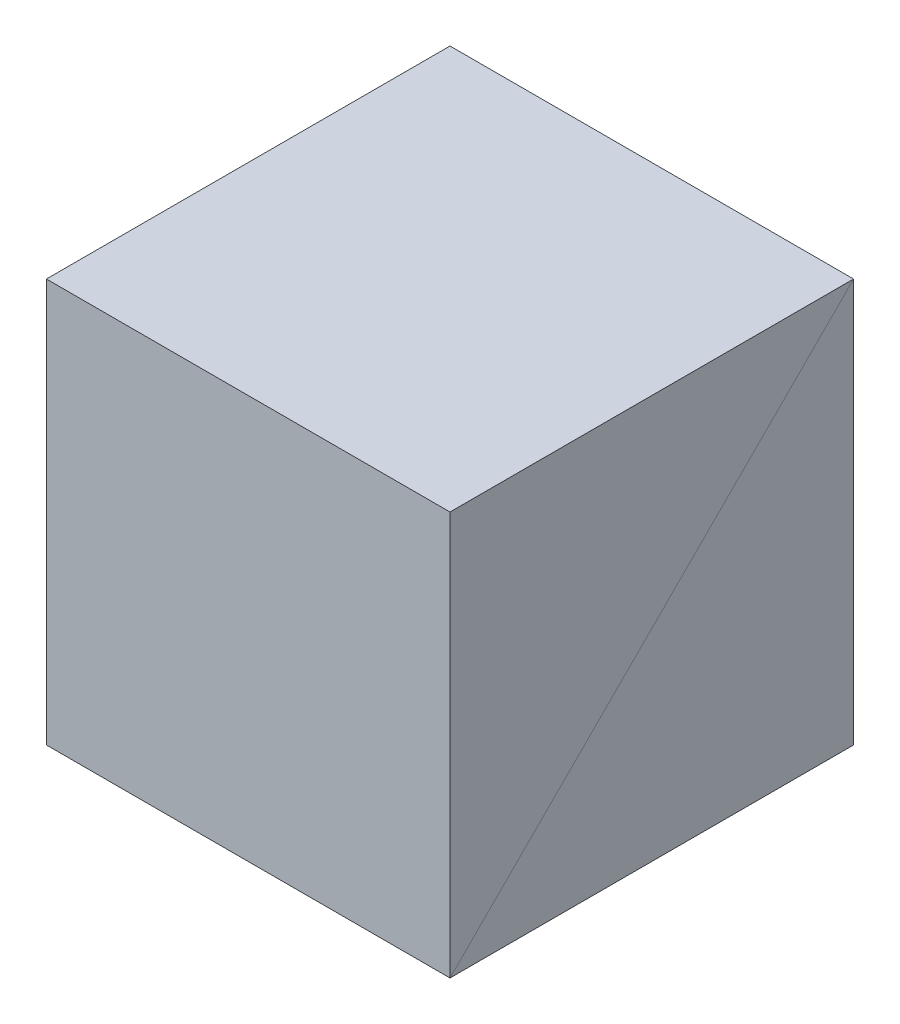
ISO-10303-21;
HEADER;
FILE_DESCRIPTION(('STEP AP214'),'2;1');
FILE_NAME('part.step','',(''),(''),'','','');
FILE_SCHEMA(('AUTOMOTIVE_DESIGN { 1 0 10303 214 1 1 1 1 }'));
ENDSEC;
DATA;
#1=APPLICATION_CONTEXT('core data for automotive mechanical design processes');
#2=APPLICATION_PROTOCOL_DEFINITION('international standard','automotive_design',2000,#1);
#3=PRODUCT_CONTEXT('',#1,'mechanical');
#4=PRODUCT('Part','Part','',(#3));
#5=PRODUCT_RELATED_PRODUCT_CATEGORY('part','',(#4));
#6=PRODUCT_DEFINITION_FORMATION('','',#4);
#7=PRODUCT_DEFINITION_CONTEXT('part definition',#1,'design');
#8=PRODUCT_DEFINITION('design','',#6,#7);
#9=PRODUCT_DEFINITION_SHAPE('','',#8);
#10=(LENGTH_UNIT() NAMED_UNIT(*) SI_UNIT(.MILLI.,.METRE.));
#11=(NAMED_UNIT(*) PLANE_ANGLE_UNIT() SI_UNIT($,.RADIAN.));
#12=(NAMED_UNIT(*) SI_UNIT($,.STERADIAN.) SOLID_ANGLE_UNIT());
#13=UNCERTAINTY_MEASURE_WITH_UNIT(LENGTH_MEASURE(1.E-05),#10,'distance_accuracy_value','');
#14=(GEOMETRIC_REPRESENTATION_CONTEXT(3) GLOBAL_UNCERTAINTY_ASSIGNED_CONTEXT((#13)) GLOBAL_UNIT_ASSIGNED_CONTEXT((#10,
#11,#12)) REPRESENTATION_CONTEXT('',''));
#15=CARTESIAN_POINT('',(0.,0.,0.));
#16=DIRECTION('',(0.,0.,1.));
#17=DIRECTION('',(1.,0.,0.));
#18=AXIS2_PLACEMENT_3D('',#15,#16,#17);
#19=CARTESIAN_POINT('',(0.,0.,0.));
#20=DIRECTION('',(0.,-1.,0.));
#21=DIRECTION('',(0.,0.,-1.));
#22=AXIS2_PLACEMENT_3D('',#19,#20,#21);
#23=PLANE('',#22);
#24=DIRECTION('',(1.,0.,0.));
#25=VECTOR('',#24,1.);
#26=CARTESIAN_POINT('',(-100.,0.,100.));
#27=LINE('',#26,#25);
#28=CARTESIAN_POINT('',(-100.,0.,100.));
#29=VERTEX_POINT('',#28);
#30=CARTESIAN_POINT('',(100.,0.,100.));
#31=VERTEX_POINT('',#30);
#32=EDGE_CURVE('E59',#29,#31,#27,.T.);
#33=ORIENTED_EDGE('',*,*,#32,.F.);
#34=DIRECTION('',(0.,0.,1.));
#35=VECTOR('',#34,1.);
#36=CARTESIAN_POINT('',(-100.,0.,-100.));
#37=LINE('',#36,#35);
#38=CARTESIAN_POINT('',(-100.,0.,-100.));
#39=VERTEX_POINT('',#38);
#40=EDGE_CURVE('E82',#39,#29,#37,.T.);
#41=ORIENTED_EDGE('',*,*,#40,.F.);
#42=DIRECTION('',(-1.,0.,0.));
#43=VECTOR('',#42,1.);
#44=CARTESIAN_POINT('',(100.,0.,-100.));
#45=LINE('',#44,#43);
#46=CARTESIAN_POINT('',(100.,0.,-100.));
#47=VERTEX_POINT('',#46);
#48=EDGE_CURVE('E87',#47,#39,#45,.T.);
#49=ORIENTED_EDGE('',*,*,#48,.F.);
#50=DIRECTION('',(0.,0.,-1.));
#51=VECTOR('',#50,1.);
#52=CARTESIAN_POINT('',(100.,0.,100.));
#53=LINE('',#52,#51);
#54=EDGE_CURVE('E102',#31,#47,#53,.T.);
#55=ORIENTED_EDGE('',*,*,#54,.F.);
#56=EDGE_LOOP('',(#33,#41,#49,#55));
#57=FACE_BOUND('',#56,.T.);
#58=ADVANCED_FACE('F51',(#57),#23,.T.);
#59=CARTESIAN_POINT('',(0.,200.,0.));
#60=DIRECTION('',(0.,1.,0.));
#61=DIRECTION('',(0.,0.,1.));
#62=AXIS2_PLACEMENT_3D('',#59,#60,#61);
#63=PLANE('',#62);
#64=DIRECTION('',(1.,0.,0.));
#65=VECTOR('',#64,1.);
#66=CARTESIAN_POINT('',(-100.,200.,100.));
#67=LINE('',#66,#65);
#68=CARTESIAN_POINT('',(-100.,200.,100.));
#69=VERTEX_POINT('',#68);
#70=CARTESIAN_POINT('',(100.,200.,100.));
#71=VERTEX_POINT('',#70);
#72=EDGE_CURVE('E111',#69,#71,#67,.T.);
#73=ORIENTED_EDGE('',*,*,#72,.T.);
#74=DIRECTION('',(0.,0.,-1.));
#75=VECTOR('',#74,1.);
#76=CARTESIAN_POINT('',(100.,200.,100.));
#77=LINE('',#76,#75);
#78=CARTESIAN_POINT('',(100.,200.,-100.));
#79=VERTEX_POINT('',#78);
#80=EDGE_CURVE('E100',#71,#79,#77,.T.);
#81=ORIENTED_EDGE('',*,*,#80,.T.);
#82=DIRECTION('',(-1.,0.,0.));
#83=VECTOR('',#82,1.);
#84=CARTESIAN_POINT('',(100.,200.,-100.));
#85=LINE('',#84,#83);
#86=CARTESIAN_POINT('',(-100.,200.,-100.));
#87=VERTEX_POINT('',#86);
#88=EDGE_CURVE('E103',#79,#87,#85,.T.);
#89=ORIENTED_EDGE('',*,*,#88,.T.);
#90=DIRECTION('',(0.,0.,1.));
#91=VECTOR('',#90,1.);
#92=CARTESIAN_POINT('',(-100.,200.,-100.));
#93=LINE('',#92,#91);
#94=EDGE_CURVE('E108',#87,#69,#93,.T.);
#95=ORIENTED_EDGE('',*,*,#94,.T.);
#96=EDGE_LOOP('',(#73,#81,#89,#95));
#97=FACE_BOUND('',#96,.T.);
#98=ADVANCED_FACE('F110',(#97),#63,.T.);
#99=CARTESIAN_POINT('',(100.,-282.842712474619,100.));
#100=DIRECTION('',(1.,0.,0.));
#101=DIRECTION('',(0.,0.,-1.));
#102=AXIS2_PLACEMENT_3D('',#99,#100,#101);
#103=PLANE('',#102);
#104=DIRECTION('',(0.,1.,0.));
#105=VECTOR('',#104,1.);
#106=CARTESIAN_POINT('',(100.,-282.842712474619,100.));
#107=LINE('',#106,#105);
#108=EDGE_CURVE('E12',#31,#71,#107,.T.);
#109=ORIENTED_EDGE('',*,*,#108,.F.);
#110=ORIENTED_EDGE('',*,*,#54,.T.);
#111=DIRECTION('',(0.,1.,0.));
#112=VECTOR('',#111,1.);
#113=CARTESIAN_POINT('',(100.,-282.842712474619,-100.));
#114=LINE('',#113,#112);
#115=EDGE_CURVE('E97',#47,#79,#114,.T.);
#116=ORIENTED_EDGE('',*,*,#115,.T.);
#117=ORIENTED_EDGE('',*,*,#80,.F.);
#118=EDGE_LOOP('',(#109,#110,#116,#117));
#119=FACE_BOUND('',#118,.T.);
#120=ADVANCED_FACE('F98',(#119),#103,.T.);
#121=CARTESIAN_POINT('',(100.,-282.842712474619,-100.));
#122=DIRECTION('',(0.,0.,-1.));
#123=DIRECTION('',(-1.,0.,0.));
#124=AXIS2_PLACEMENT_3D('',#121,#122,#123);
#125=PLANE('',#124);
#126=ORIENTED_EDGE('',*,*,#115,.F.);
#127=ORIENTED_EDGE('',*,*,#48,.T.);
#128=DIRECTION('',(0.,1.,0.));
#129=VECTOR('',#128,1.);
#130=CARTESIAN_POINT('',(-100.,-282.842712474619,-100.));
#131=LINE('',#130,#129);
#132=EDGE_CURVE('E92',#39,#87,#131,.T.);
#133=ORIENTED_EDGE('',*,*,#132,.T.);
#134=ORIENTED_EDGE('',*,*,#88,.F.);
#135=EDGE_LOOP('',(#126,#127,#133,#134));
#136=FACE_BOUND('',#135,.T.);
#137=ADVANCED_FACE('F104',(#136),#125,.T.);
#138=CARTESIAN_POINT('',(-100.,-282.842712474619,-100.));
#139=DIRECTION('',(-1.,0.,0.));
#140=DIRECTION('',(0.,0.,1.));
#141=AXIS2_PLACEMENT_3D('',#138,#139,#140);
#142=PLANE('',#141);
#143=ORIENTED_EDGE('',*,*,#132,.F.);
#144=ORIENTED_EDGE('',*,*,#40,.T.);
#145=DIRECTION('',(0.,1.,0.));
#146=VECTOR('',#145,1.);
#147=CARTESIAN_POINT('',(-100.,-282.842712474619,100.));
#148=LINE('',#147,#146);
#149=EDGE_CURVE('E118',#29,#69,#148,.T.);
#150=ORIENTED_EDGE('',*,*,#149,.T.);
#151=ORIENTED_EDGE('',*,*,#94,.F.);
#152=EDGE_LOOP('',(#143,#144,#150,#151));
#153=FACE_BOUND('',#152,.T.);
#154=ADVANCED_FACE('F124',(#153),#142,.T.);
#155=CARTESIAN_POINT('',(-100.,-282.842712474619,100.));
#156=DIRECTION('',(0.,0.,1.));
#157=DIRECTION('',(1.,0.,0.));
#158=AXIS2_PLACEMENT_3D('',#155,#156,#157);
#159=PLANE('',#158);
#160=ORIENTED_EDGE('',*,*,#149,.F.);
#161=ORIENTED_EDGE('',*,*,#32,.T.);
#162=ORIENTED_EDGE('',*,*,#108,.T.);
#163=ORIENTED_EDGE('',*,*,#72,.F.);
#164=EDGE_LOOP('',(#160,#161,#162,#163));
#165=FACE_BOUND('',#164,.T.);
#166=ADVANCED_FACE('F125',(#165),#159,.T.);
#167=CLOSED_SHELL('',(#58,#98,#120,#137,#154,#166));
#168=MANIFOLD_SOLID_BREP('B2',#167);
#169=CARTESIAN_POINT('',(100.,200.,100.));
#170=DIRECTION('',(-1.,0.,0.));
#171=DIRECTION('',(0.,0.,1.));
#172=AXIS2_PLACEMENT_3D('',#169,#170,#171);
#173=PLANE('',#172);
#174=DIRECTION('',(0.,0.,-1.));
#175=VECTOR('',#174,1.);
#176=CARTESIAN_POINT('',(100.,0.,100.));
#177=LINE('',#176,#175);
#178=CARTESIAN_POINT('',(100.,0.,100.));
#179=VERTEX_POINT('',#178);
#180=CARTESIAN_POINT('',(100.,0.,-100.));
#181=VERTEX_POINT('',#180);
#182=EDGE_CURVE('E250',#179,#181,#177,.T.);
#183=ORIENTED_EDGE('',*,*,#182,.T.);
#184=DIRECTION('',(0.,-1.,0.));
#185=VECTOR('',#184,1.);
#186=CARTESIAN_POINT('',(100.,200.,-100.));
#187=LINE('',#186,#185);
#188=CARTESIAN_POINT('',(100.,200.,-100.));
#189=VERTEX_POINT('',#188);
#190=EDGE_CURVE('E49',#189,#181,#187,.T.);
#191=ORIENTED_EDGE('',*,*,#190,.F.);
#192=DIRECTION('',(0.,0.,-1.));
#193=VECTOR('',#192,1.);
#194=CARTESIAN_POINT('',(100.,200.,100.));
#195=LINE('',#194,#193);
#196=CARTESIAN_POINT('',(100.,200.,100.));
#197=VERTEX_POINT('',#196);
#198=EDGE_CURVE('E238',#197,#189,#195,.T.);
#199=ORIENTED_EDGE('',*,*,#198,.F.);
#200=DIRECTION('',(0.,-1.,0.));
#201=VECTOR('',#200,1.);
#202=CARTESIAN_POINT('',(100.,200.,100.));
#203=LINE('',#202,#201);
#204=EDGE_CURVE('E246',#197,#179,#203,.T.);
#205=ORIENTED_EDGE('',*,*,#204,.T.);
#206=EDGE_LOOP('',(#183,#191,#199,#205));
#207=FACE_BOUND('',#206,.T.);
#208=ADVANCED_FACE('F187',(#207),#173,.F.);
#209=CARTESIAN_POINT('',(-100.,200.,-100.));
#210=DIRECTION('',(0.,0.,1.));
#211=DIRECTION('',(1.,0.,0.));
#212=AXIS2_PLACEMENT_3D('',#209,#210,#211);
#213=PLANE('',#212);
#214=DIRECTION('',(-1.,0.,0.));
#215=VECTOR('',#214,1.);
#216=CARTESIAN_POINT('',(-100.,0.,-100.));
#217=LINE('',#216,#215);
#218=CARTESIAN_POINT('',(-100.,0.,-100.));
#219=VERTEX_POINT('',#218);
#220=EDGE_CURVE('E242',#181,#219,#217,.T.);
#221=ORIENTED_EDGE('',*,*,#220,.T.);
#222=DIRECTION('',(0.,-1.,0.));
#223=VECTOR('',#222,1.);
#224=CARTESIAN_POINT('',(-100.,200.,-100.));
#225=LINE('',#224,#223);
#226=CARTESIAN_POINT('',(-100.,200.,-100.));
#227=VERTEX_POINT('',#226);
#228=EDGE_CURVE('E195',#227,#219,#225,.T.);
#229=ORIENTED_EDGE('',*,*,#228,.F.);
#230=DIRECTION('',(-1.,0.,0.));
#231=VECTOR('',#230,1.);
#232=CARTESIAN_POINT('',(-100.,200.,-100.));
#233=LINE('',#232,#231);
#234=EDGE_CURVE('E233',#189,#227,#233,.T.);
#235=ORIENTED_EDGE('',*,*,#234,.F.);
#236=ORIENTED_EDGE('',*,*,#190,.T.);
#237=EDGE_LOOP('',(#221,#229,#235,#236));
#238=FACE_BOUND('',#237,.T.);
#239=ADVANCED_FACE('F241',(#238),#213,.F.);
#240=CARTESIAN_POINT('',(-100.,200.,100.));
#241=DIRECTION('',(1.,0.,0.));
#242=DIRECTION('',(0.,0.,-1.));
#243=AXIS2_PLACEMENT_3D('',#240,#241,#242);
#244=PLANE('',#243);
#245=DIRECTION('',(0.,0.,1.));
#246=VECTOR('',#245,1.);
#247=CARTESIAN_POINT('',(-100.,0.,100.));
#248=LINE('',#247,#246);
#249=CARTESIAN_POINT('',(-100.,0.,100.));
#250=VERTEX_POINT('',#249);
#251=EDGE_CURVE('E220',#219,#250,#248,.T.);
#252=ORIENTED_EDGE('',*,*,#251,.T.);
#253=DIRECTION('',(0.,-1.,0.));
#254=VECTOR('',#253,1.);
#255=CARTESIAN_POINT('',(-100.,200.,100.));
#256=LINE('',#255,#254);
#257=CARTESIAN_POINT('',(-100.,200.,100.));
#258=VERTEX_POINT('',#257);
#259=EDGE_CURVE('E243',#258,#250,#256,.T.);
#260=ORIENTED_EDGE('',*,*,#259,.F.);
#261=DIRECTION('',(0.,0.,1.));
#262=VECTOR('',#261,1.);
#263=CARTESIAN_POINT('',(-100.,200.,100.));
#264=LINE('',#263,#262);
#265=EDGE_CURVE('E236',#227,#258,#264,.T.);
#266=ORIENTED_EDGE('',*,*,#265,.F.);
#267=ORIENTED_EDGE('',*,*,#228,.T.);
#268=EDGE_LOOP('',(#252,#260,#266,#267));
#269=FACE_BOUND('',#268,.T.);
#270=ADVANCED_FACE('F244',(#269),#244,.F.);
#271=CARTESIAN_POINT('',(-100.,200.,100.));
#272=DIRECTION('',(0.,0.,-1.));
#273=DIRECTION('',(-1.,0.,0.));
#274=AXIS2_PLACEMENT_3D('',#271,#272,#273);
#275=PLANE('',#274);
#276=DIRECTION('',(1.,0.,0.));
#277=VECTOR('',#276,1.);
#278=CARTESIAN_POINT('',(-100.,0.,100.));
#279=LINE('',#278,#277);
#280=EDGE_CURVE('E226',#250,#179,#279,.T.);
#281=ORIENTED_EDGE('',*,*,#280,.T.);
#282=ORIENTED_EDGE('',*,*,#204,.F.);
#283=DIRECTION('',(1.,0.,0.));
#284=VECTOR('',#283,1.);
#285=CARTESIAN_POINT('',(-100.,200.,100.));
#286=LINE('',#285,#284);
#287=EDGE_CURVE('E203',#258,#197,#286,.T.);
#288=ORIENTED_EDGE('',*,*,#287,.F.);
#289=ORIENTED_EDGE('',*,*,#259,.T.);
#290=EDGE_LOOP('',(#281,#282,#288,#289));
#291=FACE_BOUND('',#290,.T.);
#292=ADVANCED_FACE('F257',(#291),#275,.F.);
#293=CARTESIAN_POINT('',(0.,200.,0.));
#294=DIRECTION('',(0.,-1.,0.));
#295=DIRECTION('',(0.,0.,-1.));
#296=AXIS2_PLACEMENT_3D('',#293,#294,#295);
#297=PLANE('',#296);
#298=ORIENTED_EDGE('',*,*,#198,.T.);
#299=ORIENTED_EDGE('',*,*,#234,.T.);
#300=ORIENTED_EDGE('',*,*,#265,.T.);
#301=ORIENTED_EDGE('',*,*,#287,.T.);
#302=EDGE_LOOP('',(#298,#299,#300,#301));
#303=FACE_BOUND('',#302,.T.);
#304=ADVANCED_FACE('F234',(#303),#297,.F.);
#305=CARTESIAN_POINT('',(0.,0.,0.));
#306=DIRECTION('',(0.,-1.,0.));
#307=DIRECTION('',(0.,0.,-1.));
#308=AXIS2_PLACEMENT_3D('',#305,#306,#307);
#309=PLANE('',#308);
#310=ORIENTED_EDGE('',*,*,#182,.F.);
#311=ORIENTED_EDGE('',*,*,#280,.F.);
#312=ORIENTED_EDGE('',*,*,#251,.F.);
#313=ORIENTED_EDGE('',*,*,#220,.F.);
#314=EDGE_LOOP('',(#310,#311,#312,#313));
#315=FACE_BOUND('',#314,.T.);
#316=ADVANCED_FACE('F260',(#315),#309,.T.);
#317=CLOSED_SHELL('',(#208,#239,#270,#292,#304,#316));
#318=MANIFOLD_SOLID_BREP('B6',#317);
#319=ADVANCED_BREP_SHAPE_REPRESENTATION('',(#18,#168,#318),#14);
#320=SHAPE_DEFINITION_REPRESENTATION(#9,#319);
ENDSEC;
END-ISO-10303-21;
